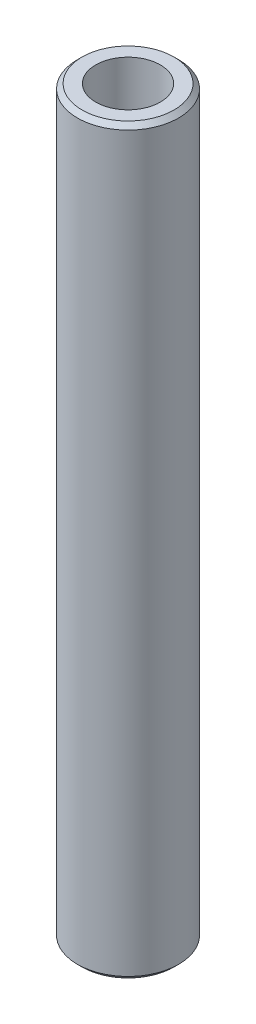
ISO-10303-21;
HEADER;
FILE_DESCRIPTION(('STEP AP214'),'2;1');
FILE_NAME('part.step','',(''),(''),'','','');
FILE_SCHEMA(('AUTOMOTIVE_DESIGN { 1 0 10303 214 1 1 1 1 }'));
ENDSEC;
DATA;
#1=APPLICATION_CONTEXT('core data for automotive mechanical design processes');
#2=APPLICATION_PROTOCOL_DEFINITION('international standard','automotive_design',2000,#1);
#3=PRODUCT_CONTEXT('',#1,'mechanical');
#4=PRODUCT('Part','Part','',(#3));
#5=PRODUCT_RELATED_PRODUCT_CATEGORY('part','',(#4));
#6=PRODUCT_DEFINITION_FORMATION('','',#4);
#7=PRODUCT_DEFINITION_CONTEXT('part definition',#1,'design');
#8=PRODUCT_DEFINITION('design','',#6,#7);
#9=PRODUCT_DEFINITION_SHAPE('','',#8);
#10=(LENGTH_UNIT() NAMED_UNIT(*) SI_UNIT(.MILLI.,.METRE.));
#11=(NAMED_UNIT(*) PLANE_ANGLE_UNIT() SI_UNIT($,.RADIAN.));
#12=(NAMED_UNIT(*) SI_UNIT($,.STERADIAN.) SOLID_ANGLE_UNIT());
#13=UNCERTAINTY_MEASURE_WITH_UNIT(LENGTH_MEASURE(1.E-05),#10,'distance_accuracy_value','');
#14=(GEOMETRIC_REPRESENTATION_CONTEXT(3) GLOBAL_UNCERTAINTY_ASSIGNED_CONTEXT((#13)) GLOBAL_UNIT_ASSIGNED_CONTEXT((#10,
#11,#12)) REPRESENTATION_CONTEXT('',''));
#15=CARTESIAN_POINT('',(0.,0.,0.));
#16=DIRECTION('',(0.,0.,1.));
#17=DIRECTION('',(1.,0.,0.));
#18=AXIS2_PLACEMENT_3D('',#15,#16,#17);
#19=CARTESIAN_POINT('',(0.,293.418691403374,0.));
#20=DIRECTION('',(0.,-1.,0.));
#21=DIRECTION('',(0.,0.,-1.));
#22=AXIS2_PLACEMENT_3D('',#19,#20,#21);
#23=CYLINDRICAL_SURFACE('',#22,20.);
#24=CARTESIAN_POINT('',(0.,291.591769684147,0.));
#25=DIRECTION('',(0.,1.,0.));
#26=DIRECTION('',(0.,0.,1.));
#27=AXIS2_PLACEMENT_3D('',#24,#25,#26);
#28=CIRCLE('',#27,20.);
#29=CARTESIAN_POINT('',(0.,291.591769684147,-20.));
#30=VERTEX_POINT('',#29);
#31=EDGE_CURVE('E50',#30,#30,#28,.F.);
#32=ORIENTED_EDGE('',*,*,#31,.T.);
#33=EDGE_LOOP('',(#32));
#34=FACE_BOUND('',#33,.T.);
#35=CARTESIAN_POINT('',(0.,1.82692171922721,0.));
#36=DIRECTION('',(0.,1.,0.));
#37=DIRECTION('',(0.,0.,1.));
#38=AXIS2_PLACEMENT_3D('',#35,#36,#37);
#39=CIRCLE('',#38,20.);
#40=CARTESIAN_POINT('',(0.,1.82692171922721,20.));
#41=VERTEX_POINT('',#40);
#42=EDGE_CURVE('E51',#41,#41,#39,.T.);
#43=ORIENTED_EDGE('',*,*,#42,.T.);
#44=EDGE_LOOP('',(#43));
#45=FACE_BOUND('',#44,.T.);
#46=ADVANCED_FACE('F39',(#34,#45),#23,.T.);
#47=CARTESIAN_POINT('',(0.,293.418691403374,0.));
#48=DIRECTION('',(0.,1.,0.));
#49=DIRECTION('',(0.,0.,1.));
#50=AXIS2_PLACEMENT_3D('',#47,#48,#49);
#51=PLANE('',#50);
#52=CARTESIAN_POINT('',(0.,293.418691403374,0.));
#53=DIRECTION('',(0.,1.,0.));
#54=DIRECTION('',(0.,0.,1.));
#55=AXIS2_PLACEMENT_3D('',#52,#53,#54);
#56=CIRCLE('',#55,18.1730782807727);
#57=CARTESIAN_POINT('',(0.,293.418691403374,-18.1730782807728));
#58=VERTEX_POINT('',#57);
#59=EDGE_CURVE('E54',#58,#58,#56,.T.);
#60=ORIENTED_EDGE('',*,*,#59,.T.);
#61=EDGE_LOOP('',(#60));
#62=FACE_BOUND('',#61,.T.);
#63=CARTESIAN_POINT('',(0.,293.418691403374,0.));
#64=DIRECTION('',(0.,1.,0.));
#65=DIRECTION('',(0.,0.,1.));
#66=AXIS2_PLACEMENT_3D('',#63,#64,#65);
#67=CIRCLE('',#66,12.7663202337542);
#68=CARTESIAN_POINT('',(0.,293.418691403374,12.7663202337542));
#69=VERTEX_POINT('',#68);
#70=EDGE_CURVE('E58',#69,#69,#67,.T.);
#71=ORIENTED_EDGE('',*,*,#70,.F.);
#72=EDGE_LOOP('',(#71));
#73=FACE_BOUND('',#72,.T.);
#74=ADVANCED_FACE('F69',(#62,#73),#51,.T.);
#75=CARTESIAN_POINT('',(0.,0.,0.));
#76=DIRECTION('',(0.,1.,0.));
#77=DIRECTION('',(0.,0.,1.));
#78=AXIS2_PLACEMENT_3D('',#75,#76,#77);
#79=PLANE('',#78);
#80=CARTESIAN_POINT('',(0.,0.,0.));
#81=DIRECTION('',(0.,1.,0.));
#82=DIRECTION('',(0.,0.,1.));
#83=AXIS2_PLACEMENT_3D('',#80,#81,#82);
#84=CIRCLE('',#83,18.1730782807728);
#85=CARTESIAN_POINT('',(0.,0.,18.1730782807728));
#86=VERTEX_POINT('',#85);
#87=EDGE_CURVE('E10',#86,#86,#84,.F.);
#88=ORIENTED_EDGE('',*,*,#87,.T.);
#89=EDGE_LOOP('',(#88));
#90=FACE_BOUND('',#89,.T.);
#91=CARTESIAN_POINT('',(0.,0.,0.));
#92=DIRECTION('',(0.,1.,0.));
#93=DIRECTION('',(0.,0.,1.));
#94=AXIS2_PLACEMENT_3D('',#91,#92,#93);
#95=CIRCLE('',#94,12.7663202337542);
#96=CARTESIAN_POINT('',(0.,0.,12.7663202337542));
#97=VERTEX_POINT('',#96);
#98=EDGE_CURVE('E63',#97,#97,#95,.T.);
#99=ORIENTED_EDGE('',*,*,#98,.T.);
#100=EDGE_LOOP('',(#99));
#101=FACE_BOUND('',#100,.T.);
#102=ADVANCED_FACE('F75',(#90,#101),#79,.F.);
#103=CARTESIAN_POINT('',(0.,293.418691403374,0.));
#104=DIRECTION('',(0.,-1.,0.));
#105=DIRECTION('',(0.,0.,-1.));
#106=AXIS2_PLACEMENT_3D('',#103,#104,#105);
#107=CYLINDRICAL_SURFACE('',#106,12.7663202337542);
#108=ORIENTED_EDGE('',*,*,#70,.T.);
#109=EDGE_LOOP('',(#108));
#110=FACE_BOUND('',#109,.T.);
#111=ORIENTED_EDGE('',*,*,#98,.F.);
#112=EDGE_LOOP('',(#111));
#113=FACE_BOUND('',#112,.T.);
#114=ADVANCED_FACE('F70',(#110,#113),#107,.F.);
#115=CARTESIAN_POINT('',(0.,293.418691403374,0.));
#116=DIRECTION('',(0.,-1.,0.));
#117=DIRECTION('',(0.,0.,-1.));
#118=AXIS2_PLACEMENT_3D('',#115,#116,#117);
#119=CONICAL_SURFACE('',#118,18.1730782807727,0.785398163397474);
#120=CARTESIAN_POINT('',(0.,291.591769684147,-20.));
#121=CARTESIAN_POINT('',(0.,291.610800118722,-19.9809695654247));
#122=CARTESIAN_POINT('',(0.,291.629830553297,-19.9619391308495));
#123=CARTESIAN_POINT('',(0.,291.667891422448,-19.9238782616989));
#124=CARTESIAN_POINT('',(0.,291.686921857023,-19.9048478271236));
#125=CARTESIAN_POINT('',(0.,291.724982726174,-19.866786957973));
#126=CARTESIAN_POINT('',(0.,291.744013160749,-19.8477565233978));
#127=CARTESIAN_POINT('',(0.,291.782074029899,-19.8096956542472));
#128=CARTESIAN_POINT('',(0.,291.801104464475,-19.7906652196719));
#129=CARTESIAN_POINT('',(0.,291.839165333625,-19.7526043505213));
#130=CARTESIAN_POINT('',(0.,291.858195768201,-19.7335739159461));
#131=CARTESIAN_POINT('',(0.,291.896256637351,-19.6955130467955));
#132=CARTESIAN_POINT('',(0.,291.915287071926,-19.6764826122202));
#133=CARTESIAN_POINT('',(0.,291.953347941077,-19.6384217430696));
#134=CARTESIAN_POINT('',(0.,291.972378375652,-19.6193913084944));
#135=CARTESIAN_POINT('',(0.,292.010439244803,-19.5813304393438));
#136=CARTESIAN_POINT('',(0.,292.029469679378,-19.5623000047685));
#137=CARTESIAN_POINT('',(0.,292.067530548529,-19.5242391356179));
#138=CARTESIAN_POINT('',(0.,292.086560983104,-19.5052087010426));
#139=CARTESIAN_POINT('',(0.,292.124621852255,-19.4671478318921));
#140=CARTESIAN_POINT('',(0.,292.14365228683,-19.4481173973168));
#141=CARTESIAN_POINT('',(0.,292.18171315598,-19.4100565281662));
#142=CARTESIAN_POINT('',(0.,292.200743590556,-19.3910260935909));
#143=CARTESIAN_POINT('',(0.,292.238804459706,-19.3529652244404));
#144=CARTESIAN_POINT('',(0.,292.257834894281,-19.3339347898651));
#145=CARTESIAN_POINT('',(0.,292.295895763432,-19.2958739207145));
#146=CARTESIAN_POINT('',(0.,292.314926198007,-19.2768434861392));
#147=CARTESIAN_POINT('',(0.,292.352987067158,-19.2387826169887));
#148=CARTESIAN_POINT('',(0.,292.372017501733,-19.2197521824134));
#149=CARTESIAN_POINT('',(0.,292.410078370884,-19.1816913132628));
#150=CARTESIAN_POINT('',(0.,292.429108805459,-19.1626608786875));
#151=CARTESIAN_POINT('',(0.,292.46716967461,-19.124600009537));
#152=CARTESIAN_POINT('',(0.,292.486200109185,-19.1055695749617));
#153=CARTESIAN_POINT('',(0.,292.524260978336,-19.0675087058111));
#154=CARTESIAN_POINT('',(0.,292.543291412911,-19.0484782712358));
#155=CARTESIAN_POINT('',(0.,292.581352282061,-19.0104174020853));
#156=CARTESIAN_POINT('',(0.,292.600382716637,-18.99138696751));
#157=CARTESIAN_POINT('',(0.,292.638443585787,-18.9533260983594));
#158=CARTESIAN_POINT('',(0.,292.657474020362,-18.9342956637841));
#159=CARTESIAN_POINT('',(0.,292.695534889513,-18.8962347946336));
#160=CARTESIAN_POINT('',(0.,292.714565324088,-18.8772043600583));
#161=CARTESIAN_POINT('',(0.,292.752626193239,-18.8391434909077));
#162=CARTESIAN_POINT('',(0.,292.771656627814,-18.8201130563324));
#163=CARTESIAN_POINT('',(0.,292.809717496965,-18.7820521871819));
#164=CARTESIAN_POINT('',(0.,292.82874793154,-18.7630217526066));
#165=CARTESIAN_POINT('',(0.,292.866808800691,-18.724960883456));
#166=CARTESIAN_POINT('',(0.,292.885839235266,-18.7059304488807));
#167=CARTESIAN_POINT('',(0.,292.923900104416,-18.6678695797302));
#168=CARTESIAN_POINT('',(0.,292.942930538992,-18.6488391451549));
#169=CARTESIAN_POINT('',(0.,292.980991408142,-18.6107782760043));
#170=CARTESIAN_POINT('',(0.,293.000021842718,-18.591747841429));
#171=CARTESIAN_POINT('',(0.,293.038082711868,-18.5536869722784));
#172=CARTESIAN_POINT('',(0.,293.057113146443,-18.5346565377032));
#173=CARTESIAN_POINT('',(0.,293.095174015594,-18.4965956685526));
#174=CARTESIAN_POINT('',(0.,293.114204450169,-18.4775652339773));
#175=CARTESIAN_POINT('',(0.,293.15226531932,-18.4395043648267));
#176=CARTESIAN_POINT('',(0.,293.171295753895,-18.4204739302515));
#177=CARTESIAN_POINT('',(0.,293.209356623046,-18.3824130611009));
#178=CARTESIAN_POINT('',(0.,293.228387057621,-18.3633826265256));
#179=CARTESIAN_POINT('',(0.,293.266447926772,-18.3253217573751));
#180=CARTESIAN_POINT('',(0.,293.285478361347,-18.3062913227998));
#181=CARTESIAN_POINT('',(0.,293.323539230497,-18.2682304536492));
#182=CARTESIAN_POINT('',(0.,293.342569665073,-18.2492000190739));
#183=CARTESIAN_POINT('',(0.,293.380630534223,-18.2111391499233));
#184=CARTESIAN_POINT('',(0.,293.399660968799,-18.1921087153481));
#185=CARTESIAN_POINT('',(0.,293.418691403374,-18.1730782807728));
#186=B_SPLINE_CURVE_WITH_KNOTS('',3,(#120,#121,#122,#123,#124,#125,#126,#127,#128,#129,#130,
#131,#132,#133,#134,#135,#136,#137,#138,#139,#140,#141,#142,#143,#144,#145,#146,#147,#148,#149,
#150,#151,#152,#153,#154,#155,#156,#157,#158,#159,#160,#161,#162,#163,#164,#165,#166,#167,#168,
#169,#170,#171,#172,#173,#174,#175,#176,#177,#178,#179,#180,#181,#182,#183,#184,#185),
.UNSPECIFIED.,.F.,.F.,(4,2,2,2,2,2,2,2,2,2,2,2,2,2,2,2,2,2,2,2,2,2,2,2,2,2,2,2,2,2,2,2,4),(0.,
0.0807392960226471,0.161478592045294,0.242217888067939,0.322957184090625,0.403696480113272,
0.484435776135919,0.565175072158606,0.645914368181253,0.7266536642039,0.807392960226583,
0.888132256249231,0.968871552271878,1.04961084829456,1.13035014431721,1.21108944033986,
1.29182873636254,1.37256803238519,1.45330732840784,1.53404662443048,1.61478592045317,
1.69552521647582,1.77626451249846,1.85700380852115,1.93774310454379,2.01848240056644,
2.09922169658913,2.17996099261177,2.26070028863442,2.34143958465711,2.42217888067975,
2.5029181767024,2.58365747272509),.UNSPECIFIED.);
#187=EDGE_CURVE('BSEAM81',#30,#58,#186,.T.);
#188=ORIENTED_EDGE('',*,*,#31,.F.);
#189=ORIENTED_EDGE('',*,*,#59,.F.);
#190=ORIENTED_EDGE('',*,*,#187,.T.);
#191=ORIENTED_EDGE('',*,*,#187,.F.);
#192=EDGE_LOOP('',(#188,#190,#189,#191));
#193=FACE_BOUND('',#192,.T.);
#194=ADVANCED_FACE('F81',(#193),#119,.T.);
#195=CARTESIAN_POINT('',(0.,1.82692171922721,0.));
#196=DIRECTION('',(0.,1.,0.));
#197=DIRECTION('',(0.,0.,1.));
#198=AXIS2_PLACEMENT_3D('',#195,#196,#197);
#199=CONICAL_SURFACE('',#198,20.,0.785398163397451);
#200=ORIENTED_EDGE('',*,*,#87,.F.);
#201=EDGE_LOOP('',(#200));
#202=FACE_BOUND('',#201,.T.);
#203=ORIENTED_EDGE('',*,*,#42,.F.);
#204=EDGE_LOOP('',(#203));
#205=FACE_BOUND('',#204,.T.);
#206=ADVANCED_FACE('F45',(#202,#205),#199,.T.);
#207=CLOSED_SHELL('',(#46,#74,#102,#114,#194,#206));
#208=MANIFOLD_SOLID_BREP('B2',#207);
#209=ADVANCED_BREP_SHAPE_REPRESENTATION('',(#18,#208),#14);
#210=SHAPE_DEFINITION_REPRESENTATION(#9,#209);
ENDSEC;
END-ISO-10303-21;
